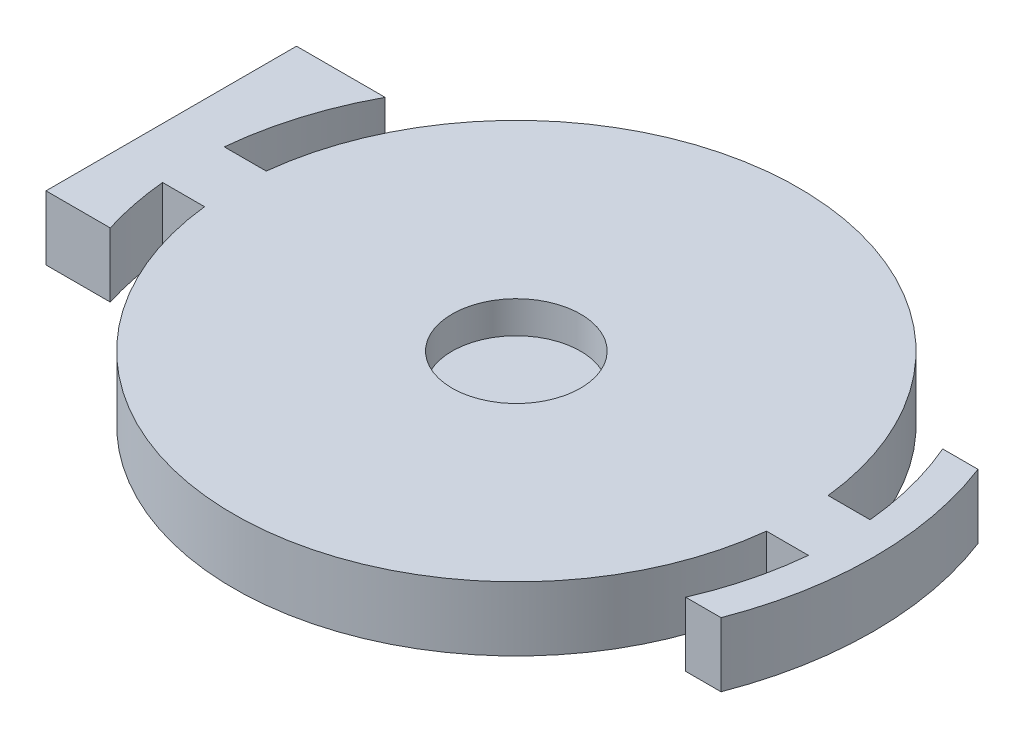
ISO-10303-21;
HEADER;
FILE_DESCRIPTION(('STEP AP214'),'2;1');
FILE_NAME('part.step','',(''),(''),'','','');
FILE_SCHEMA(('AUTOMOTIVE_DESIGN { 1 0 10303 214 1 1 1 1 }'));
ENDSEC;
DATA;
#1=APPLICATION_CONTEXT('core data for automotive mechanical design processes');
#2=APPLICATION_PROTOCOL_DEFINITION('international standard','automotive_design',2000,#1);
#3=PRODUCT_CONTEXT('',#1,'mechanical');
#4=PRODUCT('Part','Part','',(#3));
#5=PRODUCT_RELATED_PRODUCT_CATEGORY('part','',(#4));
#6=PRODUCT_DEFINITION_FORMATION('','',#4);
#7=PRODUCT_DEFINITION_CONTEXT('part definition',#1,'design');
#8=PRODUCT_DEFINITION('design','',#6,#7);
#9=PRODUCT_DEFINITION_SHAPE('','',#8);
#10=(LENGTH_UNIT() NAMED_UNIT(*) SI_UNIT(.MILLI.,.METRE.));
#11=(NAMED_UNIT(*) PLANE_ANGLE_UNIT() SI_UNIT($,.RADIAN.));
#12=(NAMED_UNIT(*) SI_UNIT($,.STERADIAN.) SOLID_ANGLE_UNIT());
#13=UNCERTAINTY_MEASURE_WITH_UNIT(LENGTH_MEASURE(1.E-05),#10,'distance_accuracy_value','');
#14=(GEOMETRIC_REPRESENTATION_CONTEXT(3) GLOBAL_UNCERTAINTY_ASSIGNED_CONTEXT((#13)) GLOBAL_UNIT_ASSIGNED_CONTEXT((#10,
#11,#12)) REPRESENTATION_CONTEXT('',''));
#15=CARTESIAN_POINT('',(0.,0.,0.));
#16=DIRECTION('',(0.,0.,1.));
#17=DIRECTION('',(1.,0.,0.));
#18=AXIS2_PLACEMENT_3D('',#15,#16,#17);
#19=CARTESIAN_POINT('',(0.,5.,0.));
#20=DIRECTION('',(0.,-1.,0.));
#21=DIRECTION('',(0.,0.,-1.));
#22=AXIS2_PLACEMENT_3D('',#19,#20,#21);
#23=CYLINDRICAL_SURFACE('',#22,22.);
#24=CARTESIAN_POINT('',(0.,0.,0.));
#25=DIRECTION('',(0.,1.,0.));
#26=DIRECTION('',(0.,0.,1.));
#27=AXIS2_PLACEMENT_3D('',#24,#25,#26);
#28=CIRCLE('',#27,22.);
#29=CARTESIAN_POINT('',(-21.8686990925386,0.,2.40000000000001));
#30=VERTEX_POINT('',#29);
#31=CARTESIAN_POINT('',(21.8686990925386,0.,2.4));
#32=VERTEX_POINT('',#31);
#33=EDGE_CURVE('E292',#30,#32,#28,.T.);
#34=ORIENTED_EDGE('',*,*,#33,.T.);
#35=DIRECTION('',(0.,-1.,0.));
#36=VECTOR('',#35,1.);
#37=CARTESIAN_POINT('',(21.8686990925386,5.,2.4));
#38=LINE('',#37,#36);
#39=CARTESIAN_POINT('',(21.8686990925386,5.,2.4));
#40=VERTEX_POINT('',#39);
#41=EDGE_CURVE('E296',#40,#32,#38,.T.);
#42=ORIENTED_EDGE('',*,*,#41,.F.);
#43=CARTESIAN_POINT('',(0.,5.,0.));
#44=DIRECTION('',(0.,1.,0.));
#45=DIRECTION('',(0.,0.,1.));
#46=AXIS2_PLACEMENT_3D('',#43,#44,#45);
#47=CIRCLE('',#46,22.);
#48=CARTESIAN_POINT('',(-21.8686990925386,5.,2.40000000000001));
#49=VERTEX_POINT('',#48);
#50=EDGE_CURVE('E291',#49,#40,#47,.T.);
#51=ORIENTED_EDGE('',*,*,#50,.F.);
#52=DIRECTION('',(0.,-1.,0.));
#53=VECTOR('',#52,1.);
#54=CARTESIAN_POINT('',(-21.8686990925386,5.,2.40000000000001));
#55=LINE('',#54,#53);
#56=EDGE_CURVE('E298',#49,#30,#55,.T.);
#57=ORIENTED_EDGE('',*,*,#56,.T.);
#58=EDGE_LOOP('',(#34,#42,#51,#57));
#59=FACE_BOUND('',#58,.T.);
#60=ADVANCED_FACE('F125',(#59),#23,.T.);
#61=CARTESIAN_POINT('',(0.,5.,0.));
#62=DIRECTION('',(0.,1.,0.));
#63=DIRECTION('',(0.,0.,1.));
#64=AXIS2_PLACEMENT_3D('',#61,#62,#63);
#65=PLANE('',#64);
#66=CARTESIAN_POINT('',(0.,5.,0.));
#67=DIRECTION('',(0.,1.,0.));
#68=DIRECTION('',(0.,0.,1.));
#69=AXIS2_PLACEMENT_3D('',#66,#67,#68);
#70=CIRCLE('',#69,5.);
#71=CARTESIAN_POINT('',(0.,5.,5.));
#72=VERTEX_POINT('',#71);
#73=EDGE_CURVE('E269',#72,#72,#70,.T.);
#74=ORIENTED_EDGE('',*,*,#73,.F.);
#75=EDGE_LOOP('',(#74));
#76=FACE_BOUND('',#75,.T.);
#77=CARTESIAN_POINT('',(0.,5.,0.));
#78=DIRECTION('',(0.,-1.,0.));
#79=DIRECTION('',(0.,0.,1.));
#80=AXIS2_PLACEMENT_3D('',#77,#78,#79);
#81=CIRCLE('',#80,25.25);
#82=CARTESIAN_POINT('',(-24.1104230572589,5.,7.49999999999999));
#83=VERTEX_POINT('',#82);
#84=CARTESIAN_POINT('',(-25.1356818089345,5.,2.39999999999999));
#85=VERTEX_POINT('',#84);
#86=EDGE_CURVE('E266',#83,#85,#81,.T.);
#87=ORIENTED_EDGE('',*,*,#86,.T.);
#88=DIRECTION('',(1.,0.,0.));
#89=VECTOR('',#88,1.);
#90=CARTESIAN_POINT('',(0.,5.,2.40000000000013));
#91=LINE('',#90,#89);
#92=EDGE_CURVE('E140',#85,#49,#91,.T.);
#93=ORIENTED_EDGE('',*,*,#92,.T.);
#94=ORIENTED_EDGE('',*,*,#50,.T.);
#95=DIRECTION('',(1.,0.,0.));
#96=VECTOR('',#95,1.);
#97=CARTESIAN_POINT('',(21.8686990925386,5.,2.4));
#98=LINE('',#97,#96);
#99=CARTESIAN_POINT('',(25.1356818089345,5.,2.4));
#100=VERTEX_POINT('',#99);
#101=EDGE_CURVE('E327',#40,#100,#98,.T.);
#102=ORIENTED_EDGE('',*,*,#101,.T.);
#103=CARTESIAN_POINT('',(0.,5.,0.));
#104=DIRECTION('',(0.,1.,0.));
#105=DIRECTION('',(0.,0.,1.));
#106=AXIS2_PLACEMENT_3D('',#103,#104,#105);
#107=CIRCLE('',#106,25.25);
#108=CARTESIAN_POINT('',(23.1853941092232,5.,10.));
#109=VERTEX_POINT('',#108);
#110=EDGE_CURVE('E324',#109,#100,#107,.T.);
#111=ORIENTED_EDGE('',*,*,#110,.F.);
#112=DIRECTION('',(1.,0.,0.));
#113=VECTOR('',#112,1.);
#114=CARTESIAN_POINT('',(23.1853941092232,5.,10.));
#115=LINE('',#114,#113);
#116=CARTESIAN_POINT('',(25.9353941092232,5.,10.));
#117=VERTEX_POINT('',#116);
#118=EDGE_CURVE('E322',#109,#117,#115,.T.);
#119=ORIENTED_EDGE('',*,*,#118,.T.);
#120=CARTESIAN_POINT('',(0.,5.,0.));
#121=DIRECTION('',(0.,1.,0.));
#122=DIRECTION('',(0.,0.,1.));
#123=AXIS2_PLACEMENT_3D('',#120,#121,#122);
#124=CIRCLE('',#123,27.7964866053379);
#125=CARTESIAN_POINT('',(25.9353941092232,5.,-10.));
#126=VERTEX_POINT('',#125);
#127=EDGE_CURVE('E320',#117,#126,#124,.T.);
#128=ORIENTED_EDGE('',*,*,#127,.T.);
#129=DIRECTION('',(1.,0.,0.));
#130=VECTOR('',#129,1.);
#131=CARTESIAN_POINT('',(23.1853941092232,5.,-10.));
#132=LINE('',#131,#130);
#133=CARTESIAN_POINT('',(23.1853941092232,5.,-10.));
#134=VERTEX_POINT('',#133);
#135=EDGE_CURVE('E316',#134,#126,#132,.T.);
#136=ORIENTED_EDGE('',*,*,#135,.F.);
#137=CARTESIAN_POINT('',(0.,5.,0.));
#138=DIRECTION('',(0.,1.,0.));
#139=DIRECTION('',(0.,0.,1.));
#140=AXIS2_PLACEMENT_3D('',#137,#138,#139);
#141=CIRCLE('',#140,25.25);
#142=CARTESIAN_POINT('',(25.1356818089345,5.,-2.4));
#143=VERTEX_POINT('',#142);
#144=EDGE_CURVE('E313',#143,#134,#141,.T.);
#145=ORIENTED_EDGE('',*,*,#144,.F.);
#146=DIRECTION('',(1.,0.,0.));
#147=VECTOR('',#146,1.);
#148=CARTESIAN_POINT('',(21.8686990925386,5.,-2.4));
#149=LINE('',#148,#147);
#150=CARTESIAN_POINT('',(21.8686990925386,5.,-2.4));
#151=VERTEX_POINT('',#150);
#152=EDGE_CURVE('E329',#151,#143,#149,.T.);
#153=ORIENTED_EDGE('',*,*,#152,.F.);
#154=CARTESIAN_POINT('',(-21.8686990925386,5.,-2.4));
#155=VERTEX_POINT('',#154);
#156=EDGE_CURVE('E288',#151,#155,#47,.T.);
#157=ORIENTED_EDGE('',*,*,#156,.T.);
#158=DIRECTION('',(1.,0.,0.));
#159=VECTOR('',#158,1.);
#160=CARTESIAN_POINT('',(0.,5.,-2.39999999999993));
#161=LINE('',#160,#159);
#162=CARTESIAN_POINT('',(-25.1356818089345,5.,-2.40000000000001));
#163=VERTEX_POINT('',#162);
#164=EDGE_CURVE('E305',#163,#155,#161,.T.);
#165=ORIENTED_EDGE('',*,*,#164,.F.);
#166=CARTESIAN_POINT('',(-22.2162665630389,5.,-12.));
#167=VERTEX_POINT('',#166);
#168=EDGE_CURVE('E278',#163,#167,#81,.T.);
#169=ORIENTED_EDGE('',*,*,#168,.T.);
#170=DIRECTION('',(-1.,0.,0.));
#171=VECTOR('',#170,1.);
#172=CARTESIAN_POINT('',(-29.1104230572589,5.,-12.));
#173=LINE('',#172,#171);
#174=CARTESIAN_POINT('',(-29.1104230572589,5.,-12.));
#175=VERTEX_POINT('',#174);
#176=EDGE_CURVE('E263',#167,#175,#173,.T.);
#177=ORIENTED_EDGE('',*,*,#176,.T.);
#178=DIRECTION('',(0.,0.,1.));
#179=VECTOR('',#178,1.);
#180=CARTESIAN_POINT('',(-29.1104230572589,5.,-12.));
#181=LINE('',#180,#179);
#182=CARTESIAN_POINT('',(-29.1104230572589,5.,7.5));
#183=VERTEX_POINT('',#182);
#184=EDGE_CURVE('E274',#175,#183,#181,.T.);
#185=ORIENTED_EDGE('',*,*,#184,.T.);
#186=DIRECTION('',(1.,0.,0.));
#187=VECTOR('',#186,1.);
#188=CARTESIAN_POINT('',(-29.1104230572589,5.,7.5));
#189=LINE('',#188,#187);
#190=EDGE_CURVE('E241',#183,#83,#189,.T.);
#191=ORIENTED_EDGE('',*,*,#190,.T.);
#192=EDGE_LOOP('',(#87,#93,#94,#102,#111,#119,#128,#136,#145,#153,#157,#165,#169,#177,#185,#191));
#193=FACE_BOUND('',#192,.T.);
#194=ADVANCED_FACE('F375',(#76,#193),#65,.T.);
#195=CARTESIAN_POINT('',(0.,0.,0.));
#196=DIRECTION('',(0.,1.,0.));
#197=DIRECTION('',(0.,0.,1.));
#198=AXIS2_PLACEMENT_3D('',#195,#196,#197);
#199=PLANE('',#198);
#200=CARTESIAN_POINT('',(0.,0.,0.));
#201=DIRECTION('',(0.,-1.,0.));
#202=DIRECTION('',(0.,0.,1.));
#203=AXIS2_PLACEMENT_3D('',#200,#201,#202);
#204=CIRCLE('',#203,25.25);
#205=CARTESIAN_POINT('',(-25.1356818089345,0.,-2.40000000000001));
#206=VERTEX_POINT('',#205);
#207=CARTESIAN_POINT('',(-22.2162665630389,0.,-12.));
#208=VERTEX_POINT('',#207);
#209=EDGE_CURVE('E259',#206,#208,#204,.T.);
#210=ORIENTED_EDGE('',*,*,#209,.F.);
#211=DIRECTION('',(1.,0.,0.));
#212=VECTOR('',#211,1.);
#213=CARTESIAN_POINT('',(0.,0.,-2.39999999999993));
#214=LINE('',#213,#212);
#215=CARTESIAN_POINT('',(-21.8686990925386,0.,-2.4));
#216=VERTEX_POINT('',#215);
#217=EDGE_CURVE('E309',#206,#216,#214,.T.);
#218=ORIENTED_EDGE('',*,*,#217,.T.);
#219=CARTESIAN_POINT('',(21.8686990925386,0.,-2.4));
#220=VERTEX_POINT('',#219);
#221=EDGE_CURVE('E293',#220,#216,#28,.T.);
#222=ORIENTED_EDGE('',*,*,#221,.F.);
#223=DIRECTION('',(1.,0.,0.));
#224=VECTOR('',#223,1.);
#225=CARTESIAN_POINT('',(21.8686990925386,0.,-2.4));
#226=LINE('',#225,#224);
#227=CARTESIAN_POINT('',(25.1356818089345,0.,-2.4));
#228=VERTEX_POINT('',#227);
#229=EDGE_CURVE('E317',#220,#228,#226,.T.);
#230=ORIENTED_EDGE('',*,*,#229,.T.);
#231=CARTESIAN_POINT('',(0.,0.,0.));
#232=DIRECTION('',(0.,1.,0.));
#233=DIRECTION('',(0.,0.,1.));
#234=AXIS2_PLACEMENT_3D('',#231,#232,#233);
#235=CIRCLE('',#234,25.25);
#236=CARTESIAN_POINT('',(23.1853941092232,0.,-10.));
#237=VERTEX_POINT('',#236);
#238=EDGE_CURVE('E287',#228,#237,#235,.T.);
#239=ORIENTED_EDGE('',*,*,#238,.T.);
#240=DIRECTION('',(1.,0.,0.));
#241=VECTOR('',#240,1.);
#242=CARTESIAN_POINT('',(23.1853941092232,0.,-10.));
#243=LINE('',#242,#241);
#244=CARTESIAN_POINT('',(25.9353941092232,0.,-10.));
#245=VERTEX_POINT('',#244);
#246=EDGE_CURVE('E335',#237,#245,#243,.T.);
#247=ORIENTED_EDGE('',*,*,#246,.T.);
#248=CARTESIAN_POINT('',(0.,0.,0.));
#249=DIRECTION('',(0.,1.,0.));
#250=DIRECTION('',(0.,0.,1.));
#251=AXIS2_PLACEMENT_3D('',#248,#249,#250);
#252=CIRCLE('',#251,27.7964866053379);
#253=CARTESIAN_POINT('',(25.9353941092232,0.,10.));
#254=VERTEX_POINT('',#253);
#255=EDGE_CURVE('E338',#254,#245,#252,.T.);
#256=ORIENTED_EDGE('',*,*,#255,.F.);
#257=DIRECTION('',(1.,0.,0.));
#258=VECTOR('',#257,1.);
#259=CARTESIAN_POINT('',(23.1853941092232,0.,10.));
#260=LINE('',#259,#258);
#261=CARTESIAN_POINT('',(23.1853941092232,0.,10.));
#262=VERTEX_POINT('',#261);
#263=EDGE_CURVE('E341',#262,#254,#260,.T.);
#264=ORIENTED_EDGE('',*,*,#263,.F.);
#265=CARTESIAN_POINT('',(0.,0.,0.));
#266=DIRECTION('',(0.,1.,0.));
#267=DIRECTION('',(0.,0.,1.));
#268=AXIS2_PLACEMENT_3D('',#265,#266,#267);
#269=CIRCLE('',#268,25.25);
#270=CARTESIAN_POINT('',(25.1356818089345,0.,2.4));
#271=VERTEX_POINT('',#270);
#272=EDGE_CURVE('E343',#262,#271,#269,.T.);
#273=ORIENTED_EDGE('',*,*,#272,.T.);
#274=DIRECTION('',(1.,0.,0.));
#275=VECTOR('',#274,1.);
#276=CARTESIAN_POINT('',(21.8686990925386,0.,2.4));
#277=LINE('',#276,#275);
#278=EDGE_CURVE('E346',#32,#271,#277,.T.);
#279=ORIENTED_EDGE('',*,*,#278,.F.);
#280=ORIENTED_EDGE('',*,*,#33,.F.);
#281=DIRECTION('',(1.,0.,0.));
#282=VECTOR('',#281,1.);
#283=CARTESIAN_POINT('',(0.,0.,2.40000000000013));
#284=LINE('',#283,#282);
#285=CARTESIAN_POINT('',(-25.1356818089345,0.,2.39999999999999));
#286=VERTEX_POINT('',#285);
#287=EDGE_CURVE('E307',#286,#30,#284,.T.);
#288=ORIENTED_EDGE('',*,*,#287,.F.);
#289=CARTESIAN_POINT('',(-24.1104230572589,0.,7.49999999999999));
#290=VERTEX_POINT('',#289);
#291=EDGE_CURVE('E258',#290,#286,#204,.T.);
#292=ORIENTED_EDGE('',*,*,#291,.F.);
#293=DIRECTION('',(1.,0.,0.));
#294=VECTOR('',#293,1.);
#295=CARTESIAN_POINT('',(-29.1104230572589,0.,7.5));
#296=LINE('',#295,#294);
#297=CARTESIAN_POINT('',(-29.1104230572589,0.,7.5));
#298=VERTEX_POINT('',#297);
#299=EDGE_CURVE('E239',#298,#290,#296,.T.);
#300=ORIENTED_EDGE('',*,*,#299,.F.);
#301=DIRECTION('',(0.,0.,1.));
#302=VECTOR('',#301,1.);
#303=CARTESIAN_POINT('',(-29.1104230572589,0.,-12.));
#304=LINE('',#303,#302);
#305=CARTESIAN_POINT('',(-29.1104230572589,0.,-12.));
#306=VERTEX_POINT('',#305);
#307=EDGE_CURVE('E255',#306,#298,#304,.T.);
#308=ORIENTED_EDGE('',*,*,#307,.F.);
#309=DIRECTION('',(-1.,0.,0.));
#310=VECTOR('',#309,1.);
#311=CARTESIAN_POINT('',(-29.1104230572589,0.,-12.));
#312=LINE('',#311,#310);
#313=EDGE_CURVE('E247',#208,#306,#312,.T.);
#314=ORIENTED_EDGE('',*,*,#313,.F.);
#315=EDGE_LOOP('',(#210,#218,#222,#230,#239,#247,#256,#264,#273,#279,#280,#288,#292,#300,#308,#314));
#316=FACE_BOUND('',#315,.T.);
#317=ADVANCED_FACE('F253',(#316),#199,.F.);
#318=ORIENTED_EDGE('',*,*,#221,.T.);
#319=DIRECTION('',(0.,-1.,0.));
#320=VECTOR('',#319,1.);
#321=CARTESIAN_POINT('',(-21.8686990925386,5.,-2.4));
#322=LINE('',#321,#320);
#323=EDGE_CURVE('E301',#155,#216,#322,.T.);
#324=ORIENTED_EDGE('',*,*,#323,.F.);
#325=ORIENTED_EDGE('',*,*,#156,.F.);
#326=DIRECTION('',(0.,-1.,0.));
#327=VECTOR('',#326,1.);
#328=CARTESIAN_POINT('',(21.8686990925386,5.,-2.4));
#329=LINE('',#328,#327);
#330=EDGE_CURVE('E133',#151,#220,#329,.T.);
#331=ORIENTED_EDGE('',*,*,#330,.T.);
#332=EDGE_LOOP('',(#318,#324,#325,#331));
#333=FACE_BOUND('',#332,.T.);
#334=ADVANCED_FACE('F414',(#333),#23,.T.);
#335=CARTESIAN_POINT('',(0.,5.,2.40000000000013));
#336=DIRECTION('',(0.,0.,-1.));
#337=DIRECTION('',(-1.,0.,0.));
#338=AXIS2_PLACEMENT_3D('',#335,#336,#337);
#339=PLANE('',#338);
#340=ORIENTED_EDGE('',*,*,#92,.F.);
#341=DIRECTION('',(0.,1.,0.));
#342=VECTOR('',#341,1.);
#343=CARTESIAN_POINT('',(-25.1356818089345,0.,2.39999999999999));
#344=LINE('',#343,#342);
#345=EDGE_CURVE('E144',#85,#286,#344,.F.);
#346=ORIENTED_EDGE('',*,*,#345,.T.);
#347=ORIENTED_EDGE('',*,*,#287,.T.);
#348=ORIENTED_EDGE('',*,*,#56,.F.);
#349=EDGE_LOOP('',(#340,#346,#347,#348));
#350=FACE_BOUND('',#349,.T.);
#351=ADVANCED_FACE('F398',(#350),#339,.F.);
#352=CARTESIAN_POINT('',(0.,5.,-2.39999999999993));
#353=DIRECTION('',(0.,0.,-1.));
#354=DIRECTION('',(-1.,0.,0.));
#355=AXIS2_PLACEMENT_3D('',#352,#353,#354);
#356=PLANE('',#355);
#357=DIRECTION('',(0.,1.,0.));
#358=VECTOR('',#357,1.);
#359=CARTESIAN_POINT('',(-25.1356818089345,0.,-2.40000000000001));
#360=LINE('',#359,#358);
#361=EDGE_CURVE('E12',#163,#206,#360,.F.);
#362=ORIENTED_EDGE('',*,*,#361,.F.);
#363=ORIENTED_EDGE('',*,*,#164,.T.);
#364=ORIENTED_EDGE('',*,*,#323,.T.);
#365=ORIENTED_EDGE('',*,*,#217,.F.);
#366=EDGE_LOOP('',(#362,#363,#364,#365));
#367=FACE_BOUND('',#366,.T.);
#368=ADVANCED_FACE('F411',(#367),#356,.T.);
#369=CARTESIAN_POINT('',(23.1853941092232,5.,-10.));
#370=DIRECTION('',(0.,0.,-1.));
#371=DIRECTION('',(-1.,0.,0.));
#372=AXIS2_PLACEMENT_3D('',#369,#370,#371);
#373=PLANE('',#372);
#374=ORIENTED_EDGE('',*,*,#246,.F.);
#375=DIRECTION('',(0.,-1.,0.));
#376=VECTOR('',#375,1.);
#377=CARTESIAN_POINT('',(23.1853941092232,5.,-10.));
#378=LINE('',#377,#376);
#379=EDGE_CURVE('E332',#134,#237,#378,.T.);
#380=ORIENTED_EDGE('',*,*,#379,.F.);
#381=ORIENTED_EDGE('',*,*,#135,.T.);
#382=DIRECTION('',(0.,-1.,0.));
#383=VECTOR('',#382,1.);
#384=CARTESIAN_POINT('',(25.9353941092232,5.,-10.));
#385=LINE('',#384,#383);
#386=EDGE_CURVE('E359',#126,#245,#385,.T.);
#387=ORIENTED_EDGE('',*,*,#386,.T.);
#388=EDGE_LOOP('',(#374,#380,#381,#387));
#389=FACE_BOUND('',#388,.T.);
#390=ADVANCED_FACE('F366',(#389),#373,.T.);
#391=CARTESIAN_POINT('',(0.,5.,0.));
#392=DIRECTION('',(0.,-1.,0.));
#393=DIRECTION('',(0.,0.,-1.));
#394=AXIS2_PLACEMENT_3D('',#391,#392,#393);
#395=CYLINDRICAL_SURFACE('',#394,27.7964866053379);
#396=ORIENTED_EDGE('',*,*,#255,.T.);
#397=ORIENTED_EDGE('',*,*,#386,.F.);
#398=ORIENTED_EDGE('',*,*,#127,.F.);
#399=DIRECTION('',(0.,-1.,0.));
#400=VECTOR('',#399,1.);
#401=CARTESIAN_POINT('',(25.9353941092232,5.,10.));
#402=LINE('',#401,#400);
#403=EDGE_CURVE('E356',#117,#254,#402,.T.);
#404=ORIENTED_EDGE('',*,*,#403,.T.);
#405=EDGE_LOOP('',(#396,#397,#398,#404));
#406=FACE_BOUND('',#405,.T.);
#407=ADVANCED_FACE('F382',(#406),#395,.T.);
#408=CARTESIAN_POINT('',(23.1853941092232,5.,10.));
#409=DIRECTION('',(0.,0.,-1.));
#410=DIRECTION('',(-1.,0.,0.));
#411=AXIS2_PLACEMENT_3D('',#408,#409,#410);
#412=PLANE('',#411);
#413=ORIENTED_EDGE('',*,*,#263,.T.);
#414=ORIENTED_EDGE('',*,*,#403,.F.);
#415=ORIENTED_EDGE('',*,*,#118,.F.);
#416=DIRECTION('',(0.,-1.,0.));
#417=VECTOR('',#416,1.);
#418=CARTESIAN_POINT('',(23.1853941092232,5.,10.));
#419=LINE('',#418,#417);
#420=EDGE_CURVE('E354',#109,#262,#419,.T.);
#421=ORIENTED_EDGE('',*,*,#420,.T.);
#422=EDGE_LOOP('',(#413,#414,#415,#421));
#423=FACE_BOUND('',#422,.T.);
#424=ADVANCED_FACE('F433',(#423),#412,.F.);
#425=CARTESIAN_POINT('',(21.8686990925386,5.,-2.4));
#426=DIRECTION('',(0.,0.,-1.));
#427=DIRECTION('',(-1.,0.,0.));
#428=AXIS2_PLACEMENT_3D('',#425,#426,#427);
#429=PLANE('',#428);
#430=ORIENTED_EDGE('',*,*,#229,.F.);
#431=ORIENTED_EDGE('',*,*,#330,.F.);
#432=ORIENTED_EDGE('',*,*,#152,.T.);
#433=DIRECTION('',(0.,-1.,0.));
#434=VECTOR('',#433,1.);
#435=CARTESIAN_POINT('',(25.1356818089345,5.,-2.4));
#436=LINE('',#435,#434);
#437=EDGE_CURVE('E311',#143,#228,#436,.T.);
#438=ORIENTED_EDGE('',*,*,#437,.T.);
#439=EDGE_LOOP('',(#430,#431,#432,#438));
#440=FACE_BOUND('',#439,.T.);
#441=ADVANCED_FACE('F372',(#440),#429,.T.);
#442=CARTESIAN_POINT('',(0.,5.,0.));
#443=DIRECTION('',(0.,-1.,0.));
#444=DIRECTION('',(0.,0.,-1.));
#445=AXIS2_PLACEMENT_3D('',#442,#443,#444);
#446=CYLINDRICAL_SURFACE('',#445,25.25);
#447=ORIENTED_EDGE('',*,*,#238,.F.);
#448=ORIENTED_EDGE('',*,*,#437,.F.);
#449=ORIENTED_EDGE('',*,*,#144,.T.);
#450=ORIENTED_EDGE('',*,*,#379,.T.);
#451=EDGE_LOOP('',(#447,#448,#449,#450));
#452=FACE_BOUND('',#451,.T.);
#453=ADVANCED_FACE('F127',(#452),#446,.F.);
#454=CARTESIAN_POINT('',(0.,5.,0.));
#455=DIRECTION('',(0.,-1.,0.));
#456=DIRECTION('',(0.,0.,-1.));
#457=AXIS2_PLACEMENT_3D('',#454,#455,#456);
#458=CYLINDRICAL_SURFACE('',#457,25.25);
#459=ORIENTED_EDGE('',*,*,#272,.F.);
#460=ORIENTED_EDGE('',*,*,#420,.F.);
#461=ORIENTED_EDGE('',*,*,#110,.T.);
#462=DIRECTION('',(0.,-1.,0.));
#463=VECTOR('',#462,1.);
#464=CARTESIAN_POINT('',(25.1356818089345,5.,2.4));
#465=LINE('',#464,#463);
#466=EDGE_CURVE('E352',#100,#271,#465,.T.);
#467=ORIENTED_EDGE('',*,*,#466,.T.);
#468=EDGE_LOOP('',(#459,#460,#461,#467));
#469=FACE_BOUND('',#468,.T.);
#470=ADVANCED_FACE('F388',(#469),#458,.F.);
#471=CARTESIAN_POINT('',(21.8686990925386,5.,2.4));
#472=DIRECTION('',(0.,0.,-1.));
#473=DIRECTION('',(-1.,0.,0.));
#474=AXIS2_PLACEMENT_3D('',#471,#472,#473);
#475=PLANE('',#474);
#476=ORIENTED_EDGE('',*,*,#278,.T.);
#477=ORIENTED_EDGE('',*,*,#466,.F.);
#478=ORIENTED_EDGE('',*,*,#101,.F.);
#479=ORIENTED_EDGE('',*,*,#41,.T.);
#480=EDGE_LOOP('',(#476,#477,#478,#479));
#481=FACE_BOUND('',#480,.T.);
#482=ADVANCED_FACE('F392',(#481),#475,.F.);
#483=CARTESIAN_POINT('',(0.,0.,0.));
#484=DIRECTION('',(0.,1.,0.));
#485=DIRECTION('',(0.,0.,1.));
#486=AXIS2_PLACEMENT_3D('',#483,#484,#485);
#487=CYLINDRICAL_SURFACE('',#486,25.25);
#488=ORIENTED_EDGE('',*,*,#345,.F.);
#489=ORIENTED_EDGE('',*,*,#86,.F.);
#490=DIRECTION('',(0.,1.,0.));
#491=VECTOR('',#490,1.);
#492=CARTESIAN_POINT('',(-24.1104230572589,0.,7.49999999999999));
#493=LINE('',#492,#491);
#494=EDGE_CURVE('E246',#290,#83,#493,.T.);
#495=ORIENTED_EDGE('',*,*,#494,.F.);
#496=ORIENTED_EDGE('',*,*,#291,.T.);
#497=EDGE_LOOP('',(#488,#489,#495,#496));
#498=FACE_BOUND('',#497,.T.);
#499=ADVANCED_FACE('F400',(#498),#487,.F.);
#500=CARTESIAN_POINT('',(-29.1104230572589,0.,-12.));
#501=DIRECTION('',(-1.,0.,0.));
#502=DIRECTION('',(0.,0.,1.));
#503=AXIS2_PLACEMENT_3D('',#500,#501,#502);
#504=PLANE('',#503);
#505=ORIENTED_EDGE('',*,*,#184,.F.);
#506=DIRECTION('',(0.,1.,0.));
#507=VECTOR('',#506,1.);
#508=CARTESIAN_POINT('',(-29.1104230572589,0.,-12.));
#509=LINE('',#508,#507);
#510=EDGE_CURVE('E262',#306,#175,#509,.T.);
#511=ORIENTED_EDGE('',*,*,#510,.F.);
#512=ORIENTED_EDGE('',*,*,#307,.T.);
#513=DIRECTION('',(0.,1.,0.));
#514=VECTOR('',#513,1.);
#515=CARTESIAN_POINT('',(-29.1104230572589,0.,7.5));
#516=LINE('',#515,#514);
#517=EDGE_CURVE('E236',#298,#183,#516,.T.);
#518=ORIENTED_EDGE('',*,*,#517,.T.);
#519=EDGE_LOOP('',(#505,#511,#512,#518));
#520=FACE_BOUND('',#519,.T.);
#521=ADVANCED_FACE('F261',(#520),#504,.T.);
#522=CARTESIAN_POINT('',(-29.1104230572589,0.,-12.));
#523=DIRECTION('',(0.,0.,-1.));
#524=DIRECTION('',(-1.,0.,0.));
#525=AXIS2_PLACEMENT_3D('',#522,#523,#524);
#526=PLANE('',#525);
#527=ORIENTED_EDGE('',*,*,#176,.F.);
#528=DIRECTION('',(0.,1.,0.));
#529=VECTOR('',#528,1.);
#530=CARTESIAN_POINT('',(-22.2162665630389,0.,-12.));
#531=LINE('',#530,#529);
#532=EDGE_CURVE('E282',#208,#167,#531,.T.);
#533=ORIENTED_EDGE('',*,*,#532,.F.);
#534=ORIENTED_EDGE('',*,*,#313,.T.);
#535=ORIENTED_EDGE('',*,*,#510,.T.);
#536=EDGE_LOOP('',(#527,#533,#534,#535));
#537=FACE_BOUND('',#536,.T.);
#538=ADVANCED_FACE('F406',(#537),#526,.T.);
#539=ORIENTED_EDGE('',*,*,#168,.F.);
#540=ORIENTED_EDGE('',*,*,#361,.T.);
#541=ORIENTED_EDGE('',*,*,#209,.T.);
#542=ORIENTED_EDGE('',*,*,#532,.T.);
#543=EDGE_LOOP('',(#539,#540,#541,#542));
#544=FACE_BOUND('',#543,.T.);
#545=ADVANCED_FACE('F408',(#544),#487,.F.);
#546=CARTESIAN_POINT('',(-29.1104230572589,0.,7.5));
#547=DIRECTION('',(0.,0.,1.));
#548=DIRECTION('',(1.,0.,0.));
#549=AXIS2_PLACEMENT_3D('',#546,#547,#548);
#550=PLANE('',#549);
#551=ORIENTED_EDGE('',*,*,#190,.F.);
#552=ORIENTED_EDGE('',*,*,#517,.F.);
#553=ORIENTED_EDGE('',*,*,#299,.T.);
#554=ORIENTED_EDGE('',*,*,#494,.T.);
#555=EDGE_LOOP('',(#551,#552,#553,#554));
#556=FACE_BOUND('',#555,.T.);
#557=ADVANCED_FACE('F238',(#556),#550,.T.);
#558=CARTESIAN_POINT('',(0.,2.5,0.));
#559=DIRECTION('',(0.,1.,0.));
#560=DIRECTION('',(0.,0.,1.));
#561=AXIS2_PLACEMENT_3D('',#558,#559,#560);
#562=CYLINDRICAL_SURFACE('',#561,5.);
#563=CARTESIAN_POINT('',(0.,2.5,0.));
#564=DIRECTION('',(0.,1.,0.));
#565=DIRECTION('',(0.,0.,1.));
#566=AXIS2_PLACEMENT_3D('',#563,#564,#565);
#567=CIRCLE('',#566,5.);
#568=CARTESIAN_POINT('',(0.,2.5,5.));
#569=VERTEX_POINT('',#568);
#570=EDGE_CURVE('E276',#569,#569,#567,.T.);
#571=ORIENTED_EDGE('',*,*,#570,.F.);
#572=EDGE_LOOP('',(#571));
#573=FACE_BOUND('',#572,.T.);
#574=ORIENTED_EDGE('',*,*,#73,.T.);
#575=EDGE_LOOP('',(#574));
#576=FACE_BOUND('',#575,.T.);
#577=ADVANCED_FACE('F494',(#573,#576),#562,.F.);
#578=CARTESIAN_POINT('',(0.,2.5,0.));
#579=DIRECTION('',(0.,1.,0.));
#580=DIRECTION('',(0.,0.,1.));
#581=AXIS2_PLACEMENT_3D('',#578,#579,#580);
#582=PLANE('',#581);
#583=ORIENTED_EDGE('',*,*,#570,.T.);
#584=EDGE_LOOP('',(#583));
#585=FACE_BOUND('',#584,.T.);
#586=ADVANCED_FACE('F501',(#585),#582,.T.);
#587=CLOSED_SHELL('',(#60,#194,#317,#334,#351,#368,#390,#407,#424,#441,#453,#470,#482,#499,#521,
#538,#545,#557,#577,#586));
#588=MANIFOLD_SOLID_BREP('B2',#587);
#589=ADVANCED_BREP_SHAPE_REPRESENTATION('',(#18,#588),#14);
#590=SHAPE_DEFINITION_REPRESENTATION(#9,#589);
ENDSEC;
END-ISO-10303-21;
